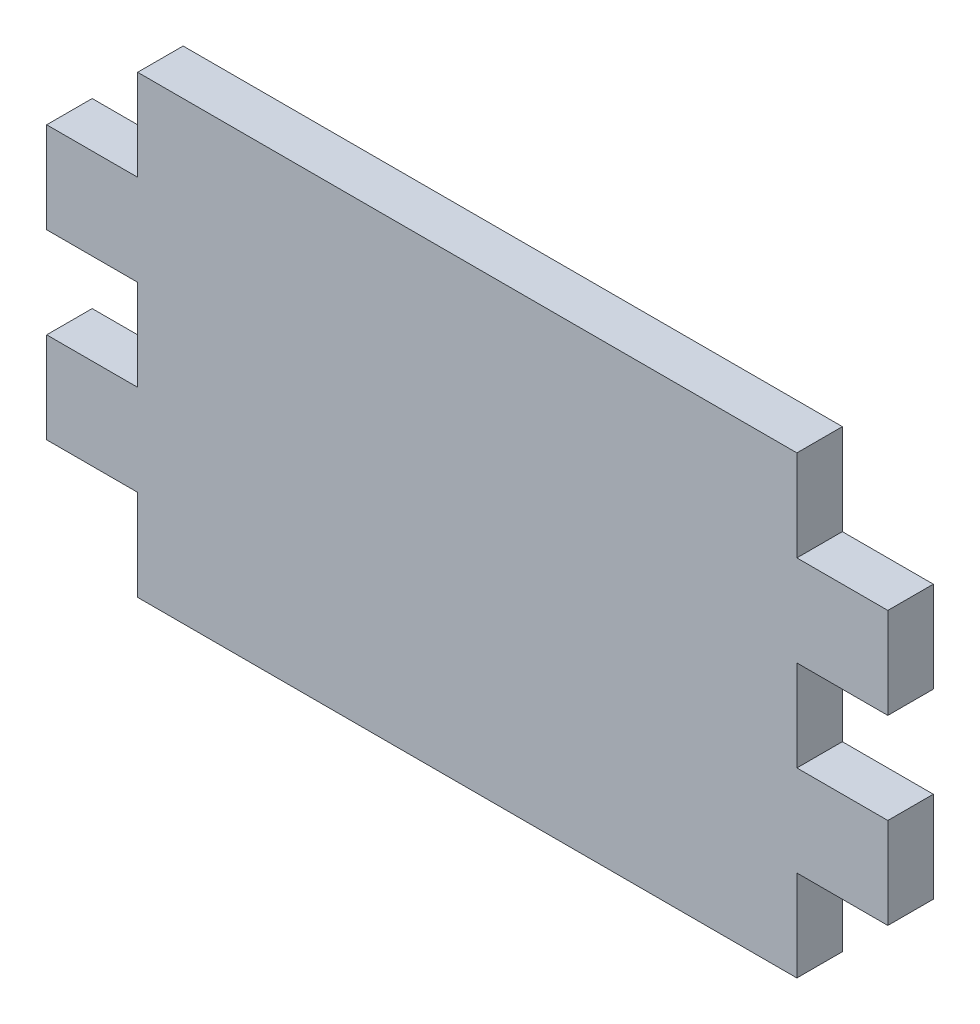
ISO-10303-21;
HEADER;
FILE_DESCRIPTION(('STEP AP214'),'2;1');
FILE_NAME('part.step','',(''),(''),'','','');
FILE_SCHEMA(('AUTOMOTIVE_DESIGN { 1 0 10303 214 1 1 1 1 }'));
ENDSEC;
DATA;
#1=APPLICATION_CONTEXT('core data for automotive mechanical design processes');
#2=APPLICATION_PROTOCOL_DEFINITION('international standard','automotive_design',2000,#1);
#3=PRODUCT_CONTEXT('',#1,'mechanical');
#4=PRODUCT('Part','Part','',(#3));
#5=PRODUCT_RELATED_PRODUCT_CATEGORY('part','',(#4));
#6=PRODUCT_DEFINITION_FORMATION('','',#4);
#7=PRODUCT_DEFINITION_CONTEXT('part definition',#1,'design');
#8=PRODUCT_DEFINITION('design','',#6,#7);
#9=PRODUCT_DEFINITION_SHAPE('','',#8);
#10=(LENGTH_UNIT() NAMED_UNIT(*) SI_UNIT(.MILLI.,.METRE.));
#11=(NAMED_UNIT(*) PLANE_ANGLE_UNIT() SI_UNIT($,.RADIAN.));
#12=(NAMED_UNIT(*) SI_UNIT($,.STERADIAN.) SOLID_ANGLE_UNIT());
#13=UNCERTAINTY_MEASURE_WITH_UNIT(LENGTH_MEASURE(1.E-05),#10,'distance_accuracy_value','');
#14=(GEOMETRIC_REPRESENTATION_CONTEXT(3) GLOBAL_UNCERTAINTY_ASSIGNED_CONTEXT((#13)) GLOBAL_UNIT_ASSIGNED_CONTEXT((#10,
#11,#12)) REPRESENTATION_CONTEXT('',''));
#15=CARTESIAN_POINT('',(0.,0.,0.));
#16=DIRECTION('',(0.,0.,1.));
#17=DIRECTION('',(1.,0.,0.));
#18=AXIS2_PLACEMENT_3D('',#15,#16,#17);
#19=CARTESIAN_POINT('',(0.,0.,3.175));
#20=DIRECTION('',(-1.,0.,0.));
#21=DIRECTION('',(0.,0.,1.));
#22=AXIS2_PLACEMENT_3D('',#19,#20,#21);
#23=PLANE('',#22);
#24=DIRECTION('',(0.,1.,0.));
#25=VECTOR('',#24,1.);
#26=CARTESIAN_POINT('',(0.,0.,0.));
#27=LINE('',#26,#25);
#28=CARTESIAN_POINT('',(0.,0.,0.));
#29=VERTEX_POINT('',#28);
#30=CARTESIAN_POINT('',(0.,6.35,0.));
#31=VERTEX_POINT('',#30);
#32=EDGE_CURVE('E201',#29,#31,#27,.T.);
#33=ORIENTED_EDGE('',*,*,#32,.T.);
#34=DIRECTION('',(0.,0.,-1.));
#35=VECTOR('',#34,1.);
#36=CARTESIAN_POINT('',(0.,6.35,3.175));
#37=LINE('',#36,#35);
#38=CARTESIAN_POINT('',(0.,6.35,3.175));
#39=VERTEX_POINT('',#38);
#40=EDGE_CURVE('E11',#39,#31,#37,.T.);
#41=ORIENTED_EDGE('',*,*,#40,.F.);
#42=DIRECTION('',(0.,1.,0.));
#43=VECTOR('',#42,1.);
#44=CARTESIAN_POINT('',(0.,0.,3.175));
#45=LINE('',#44,#43);
#46=CARTESIAN_POINT('',(0.,0.,3.175));
#47=VERTEX_POINT('',#46);
#48=EDGE_CURVE('E239',#47,#39,#45,.T.);
#49=ORIENTED_EDGE('',*,*,#48,.F.);
#50=DIRECTION('',(0.,0.,-1.));
#51=VECTOR('',#50,1.);
#52=CARTESIAN_POINT('',(0.,0.,3.175));
#53=LINE('',#52,#51);
#54=EDGE_CURVE('E197',#47,#29,#53,.T.);
#55=ORIENTED_EDGE('',*,*,#54,.T.);
#56=EDGE_LOOP('',(#33,#41,#49,#55));
#57=FACE_BOUND('',#56,.T.);
#58=ADVANCED_FACE('F33',(#57),#23,.F.);
#59=CARTESIAN_POINT('',(6.34999999999999,6.35,3.175));
#60=DIRECTION('',(0.,1.,0.));
#61=DIRECTION('',(-1.,0.,0.));
#62=AXIS2_PLACEMENT_3D('',#59,#60,#61);
#63=PLANE('',#62);
#64=DIRECTION('',(1.,0.,0.));
#65=VECTOR('',#64,1.);
#66=CARTESIAN_POINT('',(6.34999999999999,6.35,0.));
#67=LINE('',#66,#65);
#68=CARTESIAN_POINT('',(6.34999999999999,6.35,0.));
#69=VERTEX_POINT('',#68);
#70=EDGE_CURVE('E204',#31,#69,#67,.T.);
#71=ORIENTED_EDGE('',*,*,#70,.T.);
#72=DIRECTION('',(0.,0.,-1.));
#73=VECTOR('',#72,1.);
#74=CARTESIAN_POINT('',(6.34999999999999,6.35,3.175));
#75=LINE('',#74,#73);
#76=CARTESIAN_POINT('',(6.34999999999999,6.35,3.175));
#77=VERTEX_POINT('',#76);
#78=EDGE_CURVE('E41',#77,#69,#75,.T.);
#79=ORIENTED_EDGE('',*,*,#78,.F.);
#80=DIRECTION('',(1.,0.,0.));
#81=VECTOR('',#80,1.);
#82=CARTESIAN_POINT('',(6.34999999999999,6.35,3.175));
#83=LINE('',#82,#81);
#84=EDGE_CURVE('E128',#39,#77,#83,.T.);
#85=ORIENTED_EDGE('',*,*,#84,.F.);
#86=ORIENTED_EDGE('',*,*,#40,.T.);
#87=EDGE_LOOP('',(#71,#79,#85,#86));
#88=FACE_BOUND('',#87,.T.);
#89=ADVANCED_FACE('F357',(#88),#63,.F.);
#90=CARTESIAN_POINT('',(6.35,12.7,3.175));
#91=DIRECTION('',(-1.,0.,0.));
#92=DIRECTION('',(0.,-1.,0.));
#93=AXIS2_PLACEMENT_3D('',#90,#91,#92);
#94=PLANE('',#93);
#95=DIRECTION('',(0.,1.,0.));
#96=VECTOR('',#95,1.);
#97=CARTESIAN_POINT('',(6.35,12.7,0.));
#98=LINE('',#97,#96);
#99=CARTESIAN_POINT('',(6.35,12.7,0.));
#100=VERTEX_POINT('',#99);
#101=EDGE_CURVE('E206',#69,#100,#98,.T.);
#102=ORIENTED_EDGE('',*,*,#101,.T.);
#103=DIRECTION('',(0.,0.,-1.));
#104=VECTOR('',#103,1.);
#105=CARTESIAN_POINT('',(6.35,12.7,3.175));
#106=LINE('',#105,#104);
#107=CARTESIAN_POINT('',(6.35,12.7,3.175));
#108=VERTEX_POINT('',#107);
#109=EDGE_CURVE('E282',#108,#100,#106,.T.);
#110=ORIENTED_EDGE('',*,*,#109,.F.);
#111=DIRECTION('',(0.,1.,0.));
#112=VECTOR('',#111,1.);
#113=CARTESIAN_POINT('',(6.35,12.7,3.175));
#114=LINE('',#113,#112);
#115=EDGE_CURVE('E290',#77,#108,#114,.T.);
#116=ORIENTED_EDGE('',*,*,#115,.F.);
#117=ORIENTED_EDGE('',*,*,#78,.T.);
#118=EDGE_LOOP('',(#102,#110,#116,#117));
#119=FACE_BOUND('',#118,.T.);
#120=ADVANCED_FACE('F288',(#119),#94,.F.);
#121=CARTESIAN_POINT('',(6.35,12.7,3.175));
#122=DIRECTION('',(0.,-1.,0.));
#123=DIRECTION('',(1.,0.,0.));
#124=AXIS2_PLACEMENT_3D('',#121,#122,#123);
#125=PLANE('',#124);
#126=DIRECTION('',(-1.,0.,0.));
#127=VECTOR('',#126,1.);
#128=CARTESIAN_POINT('',(6.35,12.7,0.));
#129=LINE('',#128,#127);
#130=CARTESIAN_POINT('',(0.,12.7,0.));
#131=VERTEX_POINT('',#130);
#132=EDGE_CURVE('E208',#100,#131,#129,.T.);
#133=ORIENTED_EDGE('',*,*,#132,.T.);
#134=DIRECTION('',(0.,0.,-1.));
#135=VECTOR('',#134,1.);
#136=CARTESIAN_POINT('',(0.,12.7,3.175));
#137=LINE('',#136,#135);
#138=CARTESIAN_POINT('',(0.,12.7,3.175));
#139=VERTEX_POINT('',#138);
#140=EDGE_CURVE('E279',#139,#131,#137,.T.);
#141=ORIENTED_EDGE('',*,*,#140,.F.);
#142=DIRECTION('',(-1.,0.,0.));
#143=VECTOR('',#142,1.);
#144=CARTESIAN_POINT('',(6.35,12.7,3.175));
#145=LINE('',#144,#143);
#146=EDGE_CURVE('E308',#108,#139,#145,.T.);
#147=ORIENTED_EDGE('',*,*,#146,.F.);
#148=ORIENTED_EDGE('',*,*,#109,.T.);
#149=EDGE_LOOP('',(#133,#141,#147,#148));
#150=FACE_BOUND('',#149,.T.);
#151=ADVANCED_FACE('F299',(#150),#125,.F.);
#152=CARTESIAN_POINT('',(0.,12.7,3.175));
#153=DIRECTION('',(-1.,0.,0.));
#154=DIRECTION('',(0.,-1.,0.));
#155=AXIS2_PLACEMENT_3D('',#152,#153,#154);
#156=PLANE('',#155);
#157=DIRECTION('',(0.,1.,0.));
#158=VECTOR('',#157,1.);
#159=CARTESIAN_POINT('',(0.,12.7,0.));
#160=LINE('',#159,#158);
#161=CARTESIAN_POINT('',(0.,19.05,0.));
#162=VERTEX_POINT('',#161);
#163=EDGE_CURVE('E210',#131,#162,#160,.T.);
#164=ORIENTED_EDGE('',*,*,#163,.T.);
#165=DIRECTION('',(0.,0.,-1.));
#166=VECTOR('',#165,1.);
#167=CARTESIAN_POINT('',(0.,19.05,3.175));
#168=LINE('',#167,#166);
#169=CARTESIAN_POINT('',(0.,19.05,3.175));
#170=VERTEX_POINT('',#169);
#171=EDGE_CURVE('E276',#170,#162,#168,.T.);
#172=ORIENTED_EDGE('',*,*,#171,.F.);
#173=DIRECTION('',(0.,1.,0.));
#174=VECTOR('',#173,1.);
#175=CARTESIAN_POINT('',(0.,12.7,3.175));
#176=LINE('',#175,#174);
#177=EDGE_CURVE('E305',#139,#170,#176,.T.);
#178=ORIENTED_EDGE('',*,*,#177,.F.);
#179=ORIENTED_EDGE('',*,*,#140,.T.);
#180=EDGE_LOOP('',(#164,#172,#178,#179));
#181=FACE_BOUND('',#180,.T.);
#182=ADVANCED_FACE('F303',(#181),#156,.F.);
#183=CARTESIAN_POINT('',(6.34999999999999,19.05,3.175));
#184=DIRECTION('',(0.,1.,0.));
#185=DIRECTION('',(-1.,0.,0.));
#186=AXIS2_PLACEMENT_3D('',#183,#184,#185);
#187=PLANE('',#186);
#188=DIRECTION('',(1.,0.,0.));
#189=VECTOR('',#188,1.);
#190=CARTESIAN_POINT('',(6.34999999999999,19.05,0.));
#191=LINE('',#190,#189);
#192=CARTESIAN_POINT('',(6.34999999999999,19.05,0.));
#193=VERTEX_POINT('',#192);
#194=EDGE_CURVE('E212',#162,#193,#191,.T.);
#195=ORIENTED_EDGE('',*,*,#194,.T.);
#196=DIRECTION('',(0.,0.,-1.));
#197=VECTOR('',#196,1.);
#198=CARTESIAN_POINT('',(6.34999999999999,19.05,3.175));
#199=LINE('',#198,#197);
#200=CARTESIAN_POINT('',(6.34999999999999,19.05,3.175));
#201=VERTEX_POINT('',#200);
#202=EDGE_CURVE('E273',#201,#193,#199,.T.);
#203=ORIENTED_EDGE('',*,*,#202,.F.);
#204=DIRECTION('',(1.,0.,0.));
#205=VECTOR('',#204,1.);
#206=CARTESIAN_POINT('',(6.34999999999999,19.05,3.175));
#207=LINE('',#206,#205);
#208=EDGE_CURVE('E307',#170,#201,#207,.T.);
#209=ORIENTED_EDGE('',*,*,#208,.F.);
#210=ORIENTED_EDGE('',*,*,#171,.T.);
#211=EDGE_LOOP('',(#195,#203,#209,#210));
#212=FACE_BOUND('',#211,.T.);
#213=ADVANCED_FACE('F370',(#212),#187,.F.);
#214=CARTESIAN_POINT('',(6.35,25.4,3.175));
#215=DIRECTION('',(-1.,0.,0.));
#216=DIRECTION('',(0.,-1.,0.));
#217=AXIS2_PLACEMENT_3D('',#214,#215,#216);
#218=PLANE('',#217);
#219=DIRECTION('',(0.,1.,0.));
#220=VECTOR('',#219,1.);
#221=CARTESIAN_POINT('',(6.35,25.4,0.));
#222=LINE('',#221,#220);
#223=CARTESIAN_POINT('',(6.35,25.4,0.));
#224=VERTEX_POINT('',#223);
#225=EDGE_CURVE('E214',#193,#224,#222,.T.);
#226=ORIENTED_EDGE('',*,*,#225,.T.);
#227=DIRECTION('',(0.,0.,-1.));
#228=VECTOR('',#227,1.);
#229=CARTESIAN_POINT('',(6.35,25.4,3.175));
#230=LINE('',#229,#228);
#231=CARTESIAN_POINT('',(6.35,25.4,3.175));
#232=VERTEX_POINT('',#231);
#233=EDGE_CURVE('E270',#232,#224,#230,.T.);
#234=ORIENTED_EDGE('',*,*,#233,.F.);
#235=DIRECTION('',(0.,1.,0.));
#236=VECTOR('',#235,1.);
#237=CARTESIAN_POINT('',(6.35,25.4,3.175));
#238=LINE('',#237,#236);
#239=EDGE_CURVE('E310',#201,#232,#238,.T.);
#240=ORIENTED_EDGE('',*,*,#239,.F.);
#241=ORIENTED_EDGE('',*,*,#202,.T.);
#242=EDGE_LOOP('',(#226,#234,#240,#241));
#243=FACE_BOUND('',#242,.T.);
#244=ADVANCED_FACE('F373',(#243),#218,.F.);
#245=CARTESIAN_POINT('',(6.35,25.4,3.175));
#246=DIRECTION('',(0.,-1.,0.));
#247=DIRECTION('',(0.,0.,-1.));
#248=AXIS2_PLACEMENT_3D('',#245,#246,#247);
#249=PLANE('',#248);
#250=DIRECTION('',(-1.,0.,0.));
#251=VECTOR('',#250,1.);
#252=CARTESIAN_POINT('',(6.35,25.4,0.));
#253=LINE('',#252,#251);
#254=CARTESIAN_POINT('',(0.,25.4,0.));
#255=VERTEX_POINT('',#254);
#256=EDGE_CURVE('E216',#224,#255,#253,.T.);
#257=ORIENTED_EDGE('',*,*,#256,.T.);
#258=DIRECTION('',(0.,0.,-1.));
#259=VECTOR('',#258,1.);
#260=CARTESIAN_POINT('',(0.,25.4,3.175));
#261=LINE('',#260,#259);
#262=CARTESIAN_POINT('',(0.,25.4,3.175));
#263=VERTEX_POINT('',#262);
#264=EDGE_CURVE('E267',#263,#255,#261,.T.);
#265=ORIENTED_EDGE('',*,*,#264,.F.);
#266=DIRECTION('',(-1.,0.,0.));
#267=VECTOR('',#266,1.);
#268=CARTESIAN_POINT('',(6.35,25.4,3.175));
#269=LINE('',#268,#267);
#270=EDGE_CURVE('E316',#232,#263,#269,.T.);
#271=ORIENTED_EDGE('',*,*,#270,.F.);
#272=ORIENTED_EDGE('',*,*,#233,.T.);
#273=EDGE_LOOP('',(#257,#265,#271,#272));
#274=FACE_BOUND('',#273,.T.);
#275=ADVANCED_FACE('F377',(#274),#249,.F.);
#276=CARTESIAN_POINT('',(0.,25.4,3.175));
#277=DIRECTION('',(-1.,0.,0.));
#278=DIRECTION('',(0.,-1.,0.));
#279=AXIS2_PLACEMENT_3D('',#276,#277,#278);
#280=PLANE('',#279);
#281=DIRECTION('',(0.,1.,0.));
#282=VECTOR('',#281,1.);
#283=CARTESIAN_POINT('',(0.,25.4,0.));
#284=LINE('',#283,#282);
#285=CARTESIAN_POINT('',(0.,31.75,0.));
#286=VERTEX_POINT('',#285);
#287=EDGE_CURVE('E218',#255,#286,#284,.T.);
#288=ORIENTED_EDGE('',*,*,#287,.T.);
#289=DIRECTION('',(0.,0.,-1.));
#290=VECTOR('',#289,1.);
#291=CARTESIAN_POINT('',(0.,31.75,3.175));
#292=LINE('',#291,#290);
#293=CARTESIAN_POINT('',(0.,31.75,3.175));
#294=VERTEX_POINT('',#293);
#295=EDGE_CURVE('E264',#294,#286,#292,.T.);
#296=ORIENTED_EDGE('',*,*,#295,.F.);
#297=DIRECTION('',(0.,1.,0.));
#298=VECTOR('',#297,1.);
#299=CARTESIAN_POINT('',(0.,25.4,3.175));
#300=LINE('',#299,#298);
#301=EDGE_CURVE('E318',#263,#294,#300,.T.);
#302=ORIENTED_EDGE('',*,*,#301,.F.);
#303=ORIENTED_EDGE('',*,*,#264,.T.);
#304=EDGE_LOOP('',(#288,#296,#302,#303));
#305=FACE_BOUND('',#304,.T.);
#306=ADVANCED_FACE('F381',(#305),#280,.F.);
#307=CARTESIAN_POINT('',(0.,31.75,3.175));
#308=DIRECTION('',(0.,-1.,0.));
#309=DIRECTION('',(1.,0.,0.));
#310=AXIS2_PLACEMENT_3D('',#307,#308,#309);
#311=PLANE('',#310);
#312=DIRECTION('',(-1.,0.,0.));
#313=VECTOR('',#312,1.);
#314=CARTESIAN_POINT('',(0.,31.75,0.));
#315=LINE('',#314,#313);
#316=CARTESIAN_POINT('',(-46.0248,31.75,0.));
#317=VERTEX_POINT('',#316);
#318=EDGE_CURVE('E220',#286,#317,#315,.T.);
#319=ORIENTED_EDGE('',*,*,#318,.T.);
#320=DIRECTION('',(0.,0.,-1.));
#321=VECTOR('',#320,1.);
#322=CARTESIAN_POINT('',(-46.0248,31.75,3.175));
#323=LINE('',#322,#321);
#324=CARTESIAN_POINT('',(-46.0248,31.75,3.175));
#325=VERTEX_POINT('',#324);
#326=EDGE_CURVE('E261',#325,#317,#323,.T.);
#327=ORIENTED_EDGE('',*,*,#326,.F.);
#328=DIRECTION('',(-1.,0.,0.));
#329=VECTOR('',#328,1.);
#330=CARTESIAN_POINT('',(0.,31.75,3.175));
#331=LINE('',#330,#329);
#332=EDGE_CURVE('E320',#294,#325,#331,.T.);
#333=ORIENTED_EDGE('',*,*,#332,.F.);
#334=ORIENTED_EDGE('',*,*,#295,.T.);
#335=EDGE_LOOP('',(#319,#327,#333,#334));
#336=FACE_BOUND('',#335,.T.);
#337=ADVANCED_FACE('F385',(#336),#311,.F.);
#338=CARTESIAN_POINT('',(-46.0248,25.4,3.175));
#339=DIRECTION('',(1.,0.,0.));
#340=DIRECTION('',(0.,0.,-1.));
#341=AXIS2_PLACEMENT_3D('',#338,#339,#340);
#342=PLANE('',#341);
#343=DIRECTION('',(0.,-1.,0.));
#344=VECTOR('',#343,1.);
#345=CARTESIAN_POINT('',(-46.0248,25.4,0.));
#346=LINE('',#345,#344);
#347=CARTESIAN_POINT('',(-46.0248,25.4,0.));
#348=VERTEX_POINT('',#347);
#349=EDGE_CURVE('E222',#317,#348,#346,.T.);
#350=ORIENTED_EDGE('',*,*,#349,.T.);
#351=DIRECTION('',(0.,0.,-1.));
#352=VECTOR('',#351,1.);
#353=CARTESIAN_POINT('',(-46.0248,25.4,3.175));
#354=LINE('',#353,#352);
#355=CARTESIAN_POINT('',(-46.0248,25.4,3.175));
#356=VERTEX_POINT('',#355);
#357=EDGE_CURVE('E258',#356,#348,#354,.T.);
#358=ORIENTED_EDGE('',*,*,#357,.F.);
#359=DIRECTION('',(0.,-1.,0.));
#360=VECTOR('',#359,1.);
#361=CARTESIAN_POINT('',(-46.0248,25.4,3.175));
#362=LINE('',#361,#360);
#363=EDGE_CURVE('E322',#325,#356,#362,.T.);
#364=ORIENTED_EDGE('',*,*,#363,.F.);
#365=ORIENTED_EDGE('',*,*,#326,.T.);
#366=EDGE_LOOP('',(#350,#358,#364,#365));
#367=FACE_BOUND('',#366,.T.);
#368=ADVANCED_FACE('F389',(#367),#342,.F.);
#369=CARTESIAN_POINT('',(-52.3748,25.4,3.175));
#370=DIRECTION('',(0.,-1.,0.));
#371=DIRECTION('',(1.,0.,0.));
#372=AXIS2_PLACEMENT_3D('',#369,#370,#371);
#373=PLANE('',#372);
#374=DIRECTION('',(-1.,0.,0.));
#375=VECTOR('',#374,1.);
#376=CARTESIAN_POINT('',(-52.3748,25.4,0.));
#377=LINE('',#376,#375);
#378=CARTESIAN_POINT('',(-52.3748,25.4,0.));
#379=VERTEX_POINT('',#378);
#380=EDGE_CURVE('E224',#348,#379,#377,.T.);
#381=ORIENTED_EDGE('',*,*,#380,.T.);
#382=DIRECTION('',(0.,0.,-1.));
#383=VECTOR('',#382,1.);
#384=CARTESIAN_POINT('',(-52.3748,25.4,3.175));
#385=LINE('',#384,#383);
#386=CARTESIAN_POINT('',(-52.3748,25.4,3.175));
#387=VERTEX_POINT('',#386);
#388=EDGE_CURVE('E255',#387,#379,#385,.T.);
#389=ORIENTED_EDGE('',*,*,#388,.F.);
#390=DIRECTION('',(-1.,0.,0.));
#391=VECTOR('',#390,1.);
#392=CARTESIAN_POINT('',(-52.3748,25.4,3.175));
#393=LINE('',#392,#391);
#394=EDGE_CURVE('E324',#356,#387,#393,.T.);
#395=ORIENTED_EDGE('',*,*,#394,.F.);
#396=ORIENTED_EDGE('',*,*,#357,.T.);
#397=EDGE_LOOP('',(#381,#389,#395,#396));
#398=FACE_BOUND('',#397,.T.);
#399=ADVANCED_FACE('F393',(#398),#373,.F.);
#400=CARTESIAN_POINT('',(-52.3748,25.4,3.175));
#401=DIRECTION('',(1.,0.,0.));
#402=DIRECTION('',(0.,1.,0.));
#403=AXIS2_PLACEMENT_3D('',#400,#401,#402);
#404=PLANE('',#403);
#405=DIRECTION('',(0.,-1.,0.));
#406=VECTOR('',#405,1.);
#407=CARTESIAN_POINT('',(-52.3748,25.4,0.));
#408=LINE('',#407,#406);
#409=CARTESIAN_POINT('',(-52.3748,19.05,0.));
#410=VERTEX_POINT('',#409);
#411=EDGE_CURVE('E226',#379,#410,#408,.T.);
#412=ORIENTED_EDGE('',*,*,#411,.T.);
#413=DIRECTION('',(0.,0.,-1.));
#414=VECTOR('',#413,1.);
#415=CARTESIAN_POINT('',(-52.3748,19.05,3.175));
#416=LINE('',#415,#414);
#417=CARTESIAN_POINT('',(-52.3748,19.05,3.175));
#418=VERTEX_POINT('',#417);
#419=EDGE_CURVE('E252',#418,#410,#416,.T.);
#420=ORIENTED_EDGE('',*,*,#419,.F.);
#421=DIRECTION('',(0.,-1.,0.));
#422=VECTOR('',#421,1.);
#423=CARTESIAN_POINT('',(-52.3748,25.4,3.175));
#424=LINE('',#423,#422);
#425=EDGE_CURVE('E326',#387,#418,#424,.T.);
#426=ORIENTED_EDGE('',*,*,#425,.F.);
#427=ORIENTED_EDGE('',*,*,#388,.T.);
#428=EDGE_LOOP('',(#412,#420,#426,#427));
#429=FACE_BOUND('',#428,.T.);
#430=ADVANCED_FACE('F397',(#429),#404,.F.);
#431=CARTESIAN_POINT('',(-52.3748,19.05,3.175));
#432=DIRECTION('',(0.,1.,0.));
#433=DIRECTION('',(-1.,0.,0.));
#434=AXIS2_PLACEMENT_3D('',#431,#432,#433);
#435=PLANE('',#434);
#436=DIRECTION('',(1.,0.,0.));
#437=VECTOR('',#436,1.);
#438=CARTESIAN_POINT('',(-52.3748,19.05,0.));
#439=LINE('',#438,#437);
#440=CARTESIAN_POINT('',(-46.0248,19.05,0.));
#441=VERTEX_POINT('',#440);
#442=EDGE_CURVE('E228',#410,#441,#439,.T.);
#443=ORIENTED_EDGE('',*,*,#442,.T.);
#444=DIRECTION('',(0.,0.,-1.));
#445=VECTOR('',#444,1.);
#446=CARTESIAN_POINT('',(-46.0248,19.05,3.175));
#447=LINE('',#446,#445);
#448=CARTESIAN_POINT('',(-46.0248,19.05,3.175));
#449=VERTEX_POINT('',#448);
#450=EDGE_CURVE('E249',#449,#441,#447,.T.);
#451=ORIENTED_EDGE('',*,*,#450,.F.);
#452=DIRECTION('',(1.,0.,0.));
#453=VECTOR('',#452,1.);
#454=CARTESIAN_POINT('',(-52.3748,19.05,3.175));
#455=LINE('',#454,#453);
#456=EDGE_CURVE('E328',#418,#449,#455,.T.);
#457=ORIENTED_EDGE('',*,*,#456,.F.);
#458=ORIENTED_EDGE('',*,*,#419,.T.);
#459=EDGE_LOOP('',(#443,#451,#457,#458));
#460=FACE_BOUND('',#459,.T.);
#461=ADVANCED_FACE('F401',(#460),#435,.F.);
#462=CARTESIAN_POINT('',(-46.0248,12.7,3.175));
#463=DIRECTION('',(1.,0.,0.));
#464=DIRECTION('',(0.,1.,0.));
#465=AXIS2_PLACEMENT_3D('',#462,#463,#464);
#466=PLANE('',#465);
#467=DIRECTION('',(0.,-1.,0.));
#468=VECTOR('',#467,1.);
#469=CARTESIAN_POINT('',(-46.0248,12.7,0.));
#470=LINE('',#469,#468);
#471=CARTESIAN_POINT('',(-46.0248,12.7,0.));
#472=VERTEX_POINT('',#471);
#473=EDGE_CURVE('E230',#441,#472,#470,.T.);
#474=ORIENTED_EDGE('',*,*,#473,.T.);
#475=DIRECTION('',(0.,0.,-1.));
#476=VECTOR('',#475,1.);
#477=CARTESIAN_POINT('',(-46.0248,12.7,3.175));
#478=LINE('',#477,#476);
#479=CARTESIAN_POINT('',(-46.0248,12.7,3.175));
#480=VERTEX_POINT('',#479);
#481=EDGE_CURVE('E246',#480,#472,#478,.T.);
#482=ORIENTED_EDGE('',*,*,#481,.F.);
#483=DIRECTION('',(0.,-1.,0.));
#484=VECTOR('',#483,1.);
#485=CARTESIAN_POINT('',(-46.0248,12.7,3.175));
#486=LINE('',#485,#484);
#487=EDGE_CURVE('E330',#449,#480,#486,.T.);
#488=ORIENTED_EDGE('',*,*,#487,.F.);
#489=ORIENTED_EDGE('',*,*,#450,.T.);
#490=EDGE_LOOP('',(#474,#482,#488,#489));
#491=FACE_BOUND('',#490,.T.);
#492=ADVANCED_FACE('F405',(#491),#466,.F.);
#493=CARTESIAN_POINT('',(-52.3748,12.7,3.175));
#494=DIRECTION('',(0.,-1.,0.));
#495=DIRECTION('',(1.,0.,0.));
#496=AXIS2_PLACEMENT_3D('',#493,#494,#495);
#497=PLANE('',#496);
#498=DIRECTION('',(-1.,0.,0.));
#499=VECTOR('',#498,1.);
#500=CARTESIAN_POINT('',(-52.3748,12.7,0.));
#501=LINE('',#500,#499);
#502=CARTESIAN_POINT('',(-52.3748,12.7,0.));
#503=VERTEX_POINT('',#502);
#504=EDGE_CURVE('E232',#472,#503,#501,.T.);
#505=ORIENTED_EDGE('',*,*,#504,.T.);
#506=DIRECTION('',(0.,0.,-1.));
#507=VECTOR('',#506,1.);
#508=CARTESIAN_POINT('',(-52.3748,12.7,3.175));
#509=LINE('',#508,#507);
#510=CARTESIAN_POINT('',(-52.3748,12.7,3.175));
#511=VERTEX_POINT('',#510);
#512=EDGE_CURVE('E243',#511,#503,#509,.T.);
#513=ORIENTED_EDGE('',*,*,#512,.F.);
#514=DIRECTION('',(-1.,0.,0.));
#515=VECTOR('',#514,1.);
#516=CARTESIAN_POINT('',(-52.3748,12.7,3.175));
#517=LINE('',#516,#515);
#518=EDGE_CURVE('E332',#480,#511,#517,.T.);
#519=ORIENTED_EDGE('',*,*,#518,.F.);
#520=ORIENTED_EDGE('',*,*,#481,.T.);
#521=EDGE_LOOP('',(#505,#513,#519,#520));
#522=FACE_BOUND('',#521,.T.);
#523=ADVANCED_FACE('F338',(#522),#497,.F.);
#524=CARTESIAN_POINT('',(-52.3748,12.7,3.175));
#525=DIRECTION('',(1.,0.,0.));
#526=DIRECTION('',(0.,1.,0.));
#527=AXIS2_PLACEMENT_3D('',#524,#525,#526);
#528=PLANE('',#527);
#529=DIRECTION('',(0.,-1.,0.));
#530=VECTOR('',#529,1.);
#531=CARTESIAN_POINT('',(-52.3748,12.7,0.));
#532=LINE('',#531,#530);
#533=CARTESIAN_POINT('',(-52.3748,6.34999999999999,0.));
#534=VERTEX_POINT('',#533);
#535=EDGE_CURVE('E234',#503,#534,#532,.T.);
#536=ORIENTED_EDGE('',*,*,#535,.T.);
#537=DIRECTION('',(0.,0.,-1.));
#538=VECTOR('',#537,1.);
#539=CARTESIAN_POINT('',(-52.3748,6.34999999999999,3.175));
#540=LINE('',#539,#538);
#541=CARTESIAN_POINT('',(-52.3748,6.34999999999999,3.175));
#542=VERTEX_POINT('',#541);
#543=EDGE_CURVE('E192',#542,#534,#540,.T.);
#544=ORIENTED_EDGE('',*,*,#543,.F.);
#545=DIRECTION('',(0.,-1.,0.));
#546=VECTOR('',#545,1.);
#547=CARTESIAN_POINT('',(-52.3748,12.7,3.175));
#548=LINE('',#547,#546);
#549=EDGE_CURVE('E183',#511,#542,#548,.T.);
#550=ORIENTED_EDGE('',*,*,#549,.F.);
#551=ORIENTED_EDGE('',*,*,#512,.T.);
#552=EDGE_LOOP('',(#536,#544,#550,#551));
#553=FACE_BOUND('',#552,.T.);
#554=ADVANCED_FACE('F342',(#553),#528,.F.);
#555=CARTESIAN_POINT('',(-52.3748,6.34999999999999,3.175));
#556=DIRECTION('',(0.,1.,0.));
#557=DIRECTION('',(-1.,0.,0.));
#558=AXIS2_PLACEMENT_3D('',#555,#556,#557);
#559=PLANE('',#558);
#560=DIRECTION('',(1.,0.,0.));
#561=VECTOR('',#560,1.);
#562=CARTESIAN_POINT('',(-52.3748,6.34999999999999,0.));
#563=LINE('',#562,#561);
#564=CARTESIAN_POINT('',(-46.0248,6.35,0.));
#565=VERTEX_POINT('',#564);
#566=EDGE_CURVE('E191',#534,#565,#563,.T.);
#567=ORIENTED_EDGE('',*,*,#566,.T.);
#568=DIRECTION('',(0.,0.,-1.));
#569=VECTOR('',#568,1.);
#570=CARTESIAN_POINT('',(-46.0248,6.35,3.175));
#571=LINE('',#570,#569);
#572=CARTESIAN_POINT('',(-46.0248,6.35,3.175));
#573=VERTEX_POINT('',#572);
#574=EDGE_CURVE('E188',#573,#565,#571,.T.);
#575=ORIENTED_EDGE('',*,*,#574,.F.);
#576=DIRECTION('',(1.,0.,0.));
#577=VECTOR('',#576,1.);
#578=CARTESIAN_POINT('',(-52.3748,6.34999999999999,3.175));
#579=LINE('',#578,#577);
#580=EDGE_CURVE('E177',#542,#573,#579,.T.);
#581=ORIENTED_EDGE('',*,*,#580,.F.);
#582=ORIENTED_EDGE('',*,*,#543,.T.);
#583=EDGE_LOOP('',(#567,#575,#581,#582));
#584=FACE_BOUND('',#583,.T.);
#585=ADVANCED_FACE('F189',(#584),#559,.F.);
#586=CARTESIAN_POINT('',(-46.0248,0.,3.175));
#587=DIRECTION('',(1.,0.,0.));
#588=DIRECTION('',(0.,0.,-1.));
#589=AXIS2_PLACEMENT_3D('',#586,#587,#588);
#590=PLANE('',#589);
#591=DIRECTION('',(0.,-1.,0.));
#592=VECTOR('',#591,1.);
#593=CARTESIAN_POINT('',(-46.0248,0.,0.));
#594=LINE('',#593,#592);
#595=CARTESIAN_POINT('',(-46.0248,0.,0.));
#596=VERTEX_POINT('',#595);
#597=EDGE_CURVE('E114',#565,#596,#594,.T.);
#598=ORIENTED_EDGE('',*,*,#597,.T.);
#599=DIRECTION('',(0.,0.,-1.));
#600=VECTOR('',#599,1.);
#601=CARTESIAN_POINT('',(-46.0248,0.,3.175));
#602=LINE('',#601,#600);
#603=CARTESIAN_POINT('',(-46.0248,0.,3.175));
#604=VERTEX_POINT('',#603);
#605=EDGE_CURVE('E193',#604,#596,#602,.T.);
#606=ORIENTED_EDGE('',*,*,#605,.F.);
#607=DIRECTION('',(0.,-1.,0.));
#608=VECTOR('',#607,1.);
#609=CARTESIAN_POINT('',(-46.0248,0.,3.175));
#610=LINE('',#609,#608);
#611=EDGE_CURVE('E181',#573,#604,#610,.T.);
#612=ORIENTED_EDGE('',*,*,#611,.F.);
#613=ORIENTED_EDGE('',*,*,#574,.T.);
#614=EDGE_LOOP('',(#598,#606,#612,#613));
#615=FACE_BOUND('',#614,.T.);
#616=ADVANCED_FACE('F195',(#615),#590,.F.);
#617=CARTESIAN_POINT('',(0.,0.,3.175));
#618=DIRECTION('',(0.,1.,0.));
#619=DIRECTION('',(-1.,0.,0.));
#620=AXIS2_PLACEMENT_3D('',#617,#618,#619);
#621=PLANE('',#620);
#622=DIRECTION('',(1.,0.,0.));
#623=VECTOR('',#622,1.);
#624=CARTESIAN_POINT('',(0.,0.,0.));
#625=LINE('',#624,#623);
#626=EDGE_CURVE('E120',#596,#29,#625,.T.);
#627=ORIENTED_EDGE('',*,*,#626,.T.);
#628=ORIENTED_EDGE('',*,*,#54,.F.);
#629=DIRECTION('',(1.,0.,0.));
#630=VECTOR('',#629,1.);
#631=CARTESIAN_POINT('',(0.,0.,3.175));
#632=LINE('',#631,#630);
#633=EDGE_CURVE('E49',#604,#47,#632,.T.);
#634=ORIENTED_EDGE('',*,*,#633,.F.);
#635=ORIENTED_EDGE('',*,*,#605,.T.);
#636=EDGE_LOOP('',(#627,#628,#634,#635));
#637=FACE_BOUND('',#636,.T.);
#638=ADVANCED_FACE('F346',(#637),#621,.F.);
#639=CARTESIAN_POINT('',(0.,0.,3.175));
#640=DIRECTION('',(0.,0.,1.));
#641=DIRECTION('',(1.,0.,0.));
#642=AXIS2_PLACEMENT_3D('',#639,#640,#641);
#643=PLANE('',#642);
#644=ORIENTED_EDGE('',*,*,#48,.T.);
#645=ORIENTED_EDGE('',*,*,#84,.T.);
#646=ORIENTED_EDGE('',*,*,#115,.T.);
#647=ORIENTED_EDGE('',*,*,#146,.T.);
#648=ORIENTED_EDGE('',*,*,#177,.T.);
#649=ORIENTED_EDGE('',*,*,#208,.T.);
#650=ORIENTED_EDGE('',*,*,#239,.T.);
#651=ORIENTED_EDGE('',*,*,#270,.T.);
#652=ORIENTED_EDGE('',*,*,#301,.T.);
#653=ORIENTED_EDGE('',*,*,#332,.T.);
#654=ORIENTED_EDGE('',*,*,#363,.T.);
#655=ORIENTED_EDGE('',*,*,#394,.T.);
#656=ORIENTED_EDGE('',*,*,#425,.T.);
#657=ORIENTED_EDGE('',*,*,#456,.T.);
#658=ORIENTED_EDGE('',*,*,#487,.T.);
#659=ORIENTED_EDGE('',*,*,#518,.T.);
#660=ORIENTED_EDGE('',*,*,#549,.T.);
#661=ORIENTED_EDGE('',*,*,#580,.T.);
#662=ORIENTED_EDGE('',*,*,#611,.T.);
#663=ORIENTED_EDGE('',*,*,#633,.T.);
#664=EDGE_LOOP('',(#644,#645,#646,#647,#648,#649,#650,#651,#652,#653,#654,#655,#656,#657,#658,
#659,#660,#661,#662,#663));
#665=FACE_BOUND('',#664,.T.);
#666=ADVANCED_FACE('F179',(#665),#643,.T.);
#667=CARTESIAN_POINT('',(0.,0.,0.));
#668=DIRECTION('',(0.,0.,1.));
#669=DIRECTION('',(1.,0.,0.));
#670=AXIS2_PLACEMENT_3D('',#667,#668,#669);
#671=PLANE('',#670);
#672=ORIENTED_EDGE('',*,*,#32,.F.);
#673=ORIENTED_EDGE('',*,*,#626,.F.);
#674=ORIENTED_EDGE('',*,*,#597,.F.);
#675=ORIENTED_EDGE('',*,*,#566,.F.);
#676=ORIENTED_EDGE('',*,*,#535,.F.);
#677=ORIENTED_EDGE('',*,*,#504,.F.);
#678=ORIENTED_EDGE('',*,*,#473,.F.);
#679=ORIENTED_EDGE('',*,*,#442,.F.);
#680=ORIENTED_EDGE('',*,*,#411,.F.);
#681=ORIENTED_EDGE('',*,*,#380,.F.);
#682=ORIENTED_EDGE('',*,*,#349,.F.);
#683=ORIENTED_EDGE('',*,*,#318,.F.);
#684=ORIENTED_EDGE('',*,*,#287,.F.);
#685=ORIENTED_EDGE('',*,*,#256,.F.);
#686=ORIENTED_EDGE('',*,*,#225,.F.);
#687=ORIENTED_EDGE('',*,*,#194,.F.);
#688=ORIENTED_EDGE('',*,*,#163,.F.);
#689=ORIENTED_EDGE('',*,*,#132,.F.);
#690=ORIENTED_EDGE('',*,*,#101,.F.);
#691=ORIENTED_EDGE('',*,*,#70,.F.);
#692=EDGE_LOOP('',(#672,#673,#674,#675,#676,#677,#678,#679,#680,#681,#682,#683,#684,#685,#686,
#687,#688,#689,#690,#691));
#693=FACE_BOUND('',#692,.T.);
#694=ADVANCED_FACE('F294',(#693),#671,.F.);
#695=CLOSED_SHELL('',(#58,#89,#120,#151,#182,#213,#244,#275,#306,#337,#368,#399,#430,#461,#492,
#523,#554,#585,#616,#638,#666,#694));
#696=MANIFOLD_SOLID_BREP('B2',#695);
#697=ADVANCED_BREP_SHAPE_REPRESENTATION('',(#18,#696),#14);
#698=SHAPE_DEFINITION_REPRESENTATION(#9,#697);
ENDSEC;
END-ISO-10303-21;
